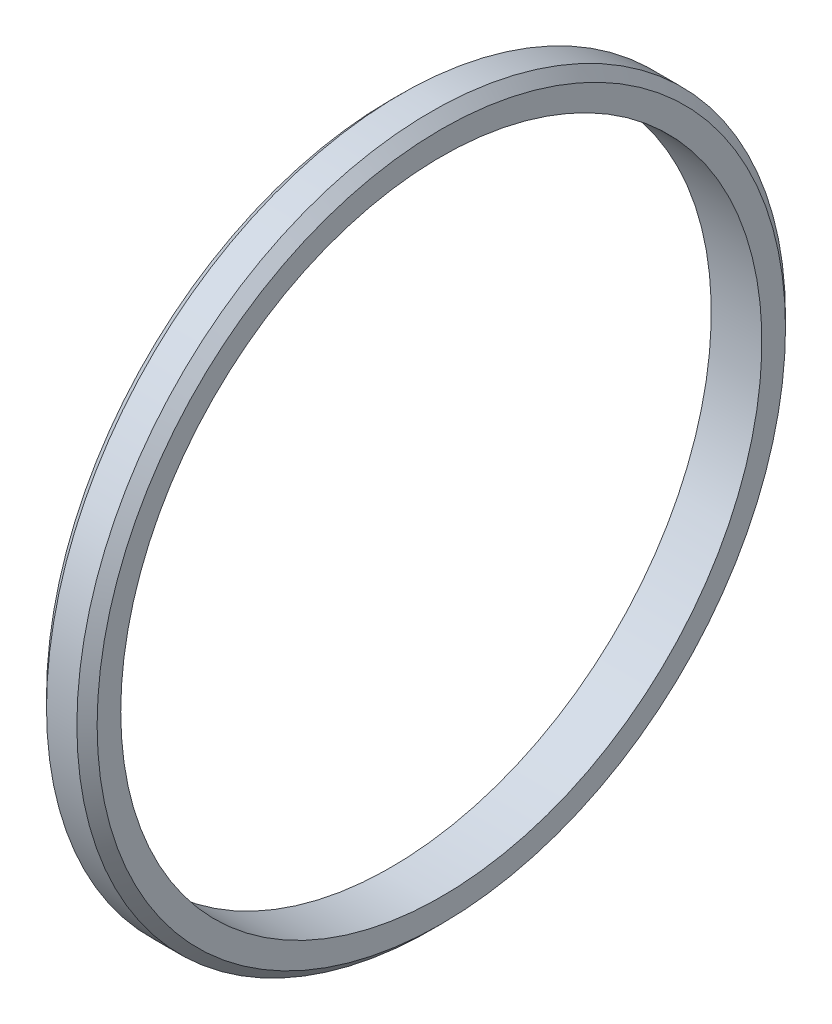
ISO-10303-21;
HEADER;
FILE_DESCRIPTION(('STEP AP214'),'2;1');
FILE_NAME('part.step','',(''),(''),'','','');
FILE_SCHEMA(('AUTOMOTIVE_DESIGN { 1 0 10303 214 1 1 1 1 }'));
ENDSEC;
DATA;
#1=APPLICATION_CONTEXT('core data for automotive mechanical design processes');
#2=APPLICATION_PROTOCOL_DEFINITION('international standard','automotive_design',2000,#1);
#3=PRODUCT_CONTEXT('',#1,'mechanical');
#4=PRODUCT('Part','Part','',(#3));
#5=PRODUCT_RELATED_PRODUCT_CATEGORY('part','',(#4));
#6=PRODUCT_DEFINITION_FORMATION('','',#4);
#7=PRODUCT_DEFINITION_CONTEXT('part definition',#1,'design');
#8=PRODUCT_DEFINITION('design','',#6,#7);
#9=PRODUCT_DEFINITION_SHAPE('','',#8);
#10=(LENGTH_UNIT() NAMED_UNIT(*) SI_UNIT(.MILLI.,.METRE.));
#11=(NAMED_UNIT(*) PLANE_ANGLE_UNIT() SI_UNIT($,.RADIAN.));
#12=(NAMED_UNIT(*) SI_UNIT($,.STERADIAN.) SOLID_ANGLE_UNIT());
#13=UNCERTAINTY_MEASURE_WITH_UNIT(LENGTH_MEASURE(1.E-05),#10,'distance_accuracy_value','');
#14=(GEOMETRIC_REPRESENTATION_CONTEXT(3) GLOBAL_UNCERTAINTY_ASSIGNED_CONTEXT((#13)) GLOBAL_UNIT_ASSIGNED_CONTEXT((#10,
#11,#12)) REPRESENTATION_CONTEXT('',''));
#15=CARTESIAN_POINT('',(0.,0.,0.));
#16=DIRECTION('',(0.,0.,1.));
#17=DIRECTION('',(1.,0.,0.));
#18=AXIS2_PLACEMENT_3D('',#15,#16,#17);
#19=CARTESIAN_POINT('',(0.,21.,0.));
#20=DIRECTION('',(1.,0.,0.));
#21=DIRECTION('',(0.,0.,-1.));
#22=AXIS2_PLACEMENT_3D('',#19,#20,#21);
#23=PLANE('',#22);
#24=CARTESIAN_POINT('',(0.,0.,0.));
#25=DIRECTION('',(1.,0.,0.));
#26=DIRECTION('',(0.,0.,-1.));
#27=AXIS2_PLACEMENT_3D('',#24,#25,#26);
#28=CIRCLE('',#27,20.4);
#29=CARTESIAN_POINT('',(0.,0.,-20.4));
#30=VERTEX_POINT('',#29);
#31=EDGE_CURVE('E47',#30,#30,#28,.F.);
#32=ORIENTED_EDGE('',*,*,#31,.T.);
#33=EDGE_LOOP('',(#32));
#34=FACE_BOUND('',#33,.T.);
#35=CARTESIAN_POINT('',(0.,0.,0.));
#36=DIRECTION('',(-1.,0.,0.));
#37=DIRECTION('',(0.,0.,1.));
#38=AXIS2_PLACEMENT_3D('',#35,#36,#37);
#39=CIRCLE('',#38,19.);
#40=CARTESIAN_POINT('',(0.,0.,19.));
#41=VERTEX_POINT('',#40);
#42=EDGE_CURVE('E52',#41,#41,#39,.T.);
#43=ORIENTED_EDGE('',*,*,#42,.F.);
#44=EDGE_LOOP('',(#43));
#45=FACE_BOUND('',#44,.T.);
#46=ADVANCED_FACE('F32',(#34,#45),#23,.F.);
#47=CARTESIAN_POINT('',(0.,0.,0.));
#48=DIRECTION('',(-1.,0.,0.));
#49=DIRECTION('',(0.,0.,1.));
#50=AXIS2_PLACEMENT_3D('',#47,#48,#49);
#51=CYLINDRICAL_SURFACE('',#50,19.);
#52=CARTESIAN_POINT('',(3.,0.,0.));
#53=DIRECTION('',(-1.,0.,0.));
#54=DIRECTION('',(0.,0.,1.));
#55=AXIS2_PLACEMENT_3D('',#52,#53,#54);
#56=CIRCLE('',#55,19.);
#57=CARTESIAN_POINT('',(3.,0.,19.));
#58=VERTEX_POINT('',#57);
#59=EDGE_CURVE('E55',#58,#58,#56,.T.);
#60=ORIENTED_EDGE('',*,*,#59,.F.);
#61=EDGE_LOOP('',(#60));
#62=FACE_BOUND('',#61,.T.);
#63=ORIENTED_EDGE('',*,*,#42,.T.);
#64=EDGE_LOOP('',(#63));
#65=FACE_BOUND('',#64,.T.);
#66=ADVANCED_FACE('F61',(#62,#65),#51,.F.);
#67=CARTESIAN_POINT('',(3.,19.,0.));
#68=DIRECTION('',(-1.,0.,0.));
#69=DIRECTION('',(0.,0.,1.));
#70=AXIS2_PLACEMENT_3D('',#67,#68,#69);
#71=PLANE('',#70);
#72=CARTESIAN_POINT('',(3.,0.,0.));
#73=DIRECTION('',(-1.,0.,0.));
#74=DIRECTION('',(0.,0.,1.));
#75=AXIS2_PLACEMENT_3D('',#72,#73,#74);
#76=CIRCLE('',#75,20.4);
#77=CARTESIAN_POINT('',(3.,0.,20.4));
#78=VERTEX_POINT('',#77);
#79=EDGE_CURVE('E10',#78,#78,#76,.F.);
#80=ORIENTED_EDGE('',*,*,#79,.T.);
#81=EDGE_LOOP('',(#80));
#82=FACE_BOUND('',#81,.T.);
#83=ORIENTED_EDGE('',*,*,#59,.T.);
#84=EDGE_LOOP('',(#83));
#85=FACE_BOUND('',#84,.T.);
#86=ADVANCED_FACE('F59',(#82,#85),#71,.F.);
#87=CARTESIAN_POINT('',(0.,0.,0.));
#88=DIRECTION('',(-1.,0.,0.));
#89=DIRECTION('',(0.,0.,1.));
#90=AXIS2_PLACEMENT_3D('',#87,#88,#89);
#91=CYLINDRICAL_SURFACE('',#90,21.);
#92=CARTESIAN_POINT('',(0.59999999999999,0.,0.));
#93=DIRECTION('',(1.,0.,0.));
#94=DIRECTION('',(0.,0.,-1.));
#95=AXIS2_PLACEMENT_3D('',#92,#93,#94);
#96=CIRCLE('',#95,21.);
#97=CARTESIAN_POINT('',(0.59999999999999,0.,-21.));
#98=VERTEX_POINT('',#97);
#99=EDGE_CURVE('E39',#98,#98,#96,.T.);
#100=ORIENTED_EDGE('',*,*,#99,.T.);
#101=EDGE_LOOP('',(#100));
#102=FACE_BOUND('',#101,.T.);
#103=CARTESIAN_POINT('',(2.4,0.,0.));
#104=DIRECTION('',(-1.,0.,0.));
#105=DIRECTION('',(0.,0.,1.));
#106=AXIS2_PLACEMENT_3D('',#103,#104,#105);
#107=CIRCLE('',#106,21.);
#108=CARTESIAN_POINT('',(2.4,0.,21.));
#109=VERTEX_POINT('',#108);
#110=EDGE_CURVE('E43',#109,#109,#107,.T.);
#111=ORIENTED_EDGE('',*,*,#110,.T.);
#112=EDGE_LOOP('',(#111));
#113=FACE_BOUND('',#112,.T.);
#114=ADVANCED_FACE('F75',(#102,#113),#91,.T.);
#115=CARTESIAN_POINT('',(0.,0.,0.));
#116=DIRECTION('',(1.,0.,0.));
#117=DIRECTION('',(0.,0.,-1.));
#118=AXIS2_PLACEMENT_3D('',#115,#116,#117);
#119=CONICAL_SURFACE('',#118,20.4,0.785398163397448);
#120=ORIENTED_EDGE('',*,*,#99,.F.);
#121=EDGE_LOOP('',(#120));
#122=FACE_BOUND('',#121,.T.);
#123=ORIENTED_EDGE('',*,*,#31,.F.);
#124=EDGE_LOOP('',(#123));
#125=FACE_BOUND('',#124,.T.);
#126=ADVANCED_FACE('F73',(#122,#125),#119,.T.);
#127=CARTESIAN_POINT('',(2.4,0.,0.));
#128=DIRECTION('',(-1.,0.,0.));
#129=DIRECTION('',(0.,0.,1.));
#130=AXIS2_PLACEMENT_3D('',#127,#128,#129);
#131=CONICAL_SURFACE('',#130,21.,0.785398163397451);
#132=ORIENTED_EDGE('',*,*,#79,.F.);
#133=EDGE_LOOP('',(#132));
#134=FACE_BOUND('',#133,.T.);
#135=ORIENTED_EDGE('',*,*,#110,.F.);
#136=EDGE_LOOP('',(#135));
#137=FACE_BOUND('',#136,.T.);
#138=ADVANCED_FACE('F34',(#134,#137),#131,.T.);
#139=CLOSED_SHELL('',(#46,#66,#86,#114,#126,#138));
#140=MANIFOLD_SOLID_BREP('B2',#139);
#141=ADVANCED_BREP_SHAPE_REPRESENTATION('',(#18,#140),#14);
#142=SHAPE_DEFINITION_REPRESENTATION(#9,#141);
ENDSEC;
END-ISO-10303-21;
